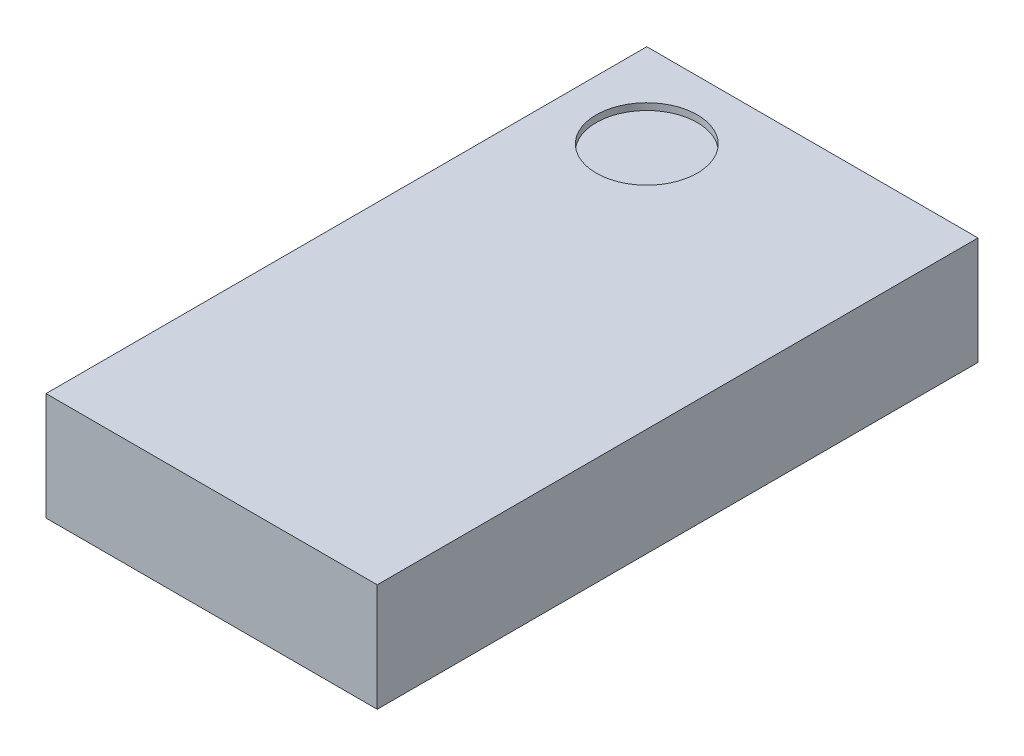
ISO-10303-21;
HEADER;
FILE_DESCRIPTION(('STEP AP214'),'2;1');
FILE_NAME('part.step','',(''),(''),'','','');
FILE_SCHEMA(('AUTOMOTIVE_DESIGN { 1 0 10303 214 1 1 1 1 }'));
ENDSEC;
DATA;
#1=APPLICATION_CONTEXT('core data for automotive mechanical design processes');
#2=APPLICATION_PROTOCOL_DEFINITION('international standard','automotive_design',2000,#1);
#3=PRODUCT_CONTEXT('',#1,'mechanical');
#4=PRODUCT('Part','Part','',(#3));
#5=PRODUCT_RELATED_PRODUCT_CATEGORY('part','',(#4));
#6=PRODUCT_DEFINITION_FORMATION('','',#4);
#7=PRODUCT_DEFINITION_CONTEXT('part definition',#1,'design');
#8=PRODUCT_DEFINITION('design','',#6,#7);
#9=PRODUCT_DEFINITION_SHAPE('','',#8);
#10=(LENGTH_UNIT() NAMED_UNIT(*) SI_UNIT(.MILLI.,.METRE.));
#11=(NAMED_UNIT(*) PLANE_ANGLE_UNIT() SI_UNIT($,.RADIAN.));
#12=(NAMED_UNIT(*) SI_UNIT($,.STERADIAN.) SOLID_ANGLE_UNIT());
#13=UNCERTAINTY_MEASURE_WITH_UNIT(LENGTH_MEASURE(1.E-05),#10,'distance_accuracy_value','');
#14=(GEOMETRIC_REPRESENTATION_CONTEXT(3) GLOBAL_UNCERTAINTY_ASSIGNED_CONTEXT((#13)) GLOBAL_UNIT_ASSIGNED_CONTEXT((#10,
#11,#12)) REPRESENTATION_CONTEXT('',''));
#15=CARTESIAN_POINT('',(0.,0.,0.));
#16=DIRECTION('',(0.,0.,1.));
#17=DIRECTION('',(1.,0.,0.));
#18=AXIS2_PLACEMENT_3D('',#15,#16,#17);
#19=CARTESIAN_POINT('',(0.4915,0.32,-0.8915));
#20=DIRECTION('',(-1.,0.,0.));
#21=DIRECTION('',(0.,0.,1.));
#22=AXIS2_PLACEMENT_3D('',#19,#20,#21);
#23=PLANE('',#22);
#24=DIRECTION('',(0.,0.,-1.));
#25=VECTOR('',#24,1.);
#26=CARTESIAN_POINT('',(0.4915,0.,-0.8915));
#27=LINE('',#26,#25);
#28=CARTESIAN_POINT('',(0.4915,0.,0.8915));
#29=VERTEX_POINT('',#28);
#30=CARTESIAN_POINT('',(0.4915,0.,-0.8915));
#31=VERTEX_POINT('',#30);
#32=EDGE_CURVE('E112',#29,#31,#27,.T.);
#33=ORIENTED_EDGE('',*,*,#32,.T.);
#34=DIRECTION('',(0.,-1.,0.));
#35=VECTOR('',#34,1.);
#36=CARTESIAN_POINT('',(0.4915,0.32,-0.8915));
#37=LINE('',#36,#35);
#38=CARTESIAN_POINT('',(0.4915,0.32,-0.8915));
#39=VERTEX_POINT('',#38);
#40=EDGE_CURVE('E101',#39,#31,#37,.T.);
#41=ORIENTED_EDGE('',*,*,#40,.F.);
#42=DIRECTION('',(0.,0.,-1.));
#43=VECTOR('',#42,1.);
#44=CARTESIAN_POINT('',(0.4915,0.32,-0.8915));
#45=LINE('',#44,#43);
#46=CARTESIAN_POINT('',(0.4915,0.32,0.8915));
#47=VERTEX_POINT('',#46);
#48=EDGE_CURVE('E93',#47,#39,#45,.T.);
#49=ORIENTED_EDGE('',*,*,#48,.F.);
#50=DIRECTION('',(0.,-1.,0.));
#51=VECTOR('',#50,1.);
#52=CARTESIAN_POINT('',(0.4915,0.32,0.8915));
#53=LINE('',#52,#51);
#54=EDGE_CURVE('E108',#47,#29,#53,.T.);
#55=ORIENTED_EDGE('',*,*,#54,.T.);
#56=EDGE_LOOP('',(#33,#41,#49,#55));
#57=FACE_BOUND('',#56,.T.);
#58=ADVANCED_FACE('F40',(#57),#23,.F.);
#59=CARTESIAN_POINT('',(-0.4915,0.32,-0.8915));
#60=DIRECTION('',(0.,0.,1.));
#61=DIRECTION('',(1.,0.,0.));
#62=AXIS2_PLACEMENT_3D('',#59,#60,#61);
#63=PLANE('',#62);
#64=DIRECTION('',(-1.,0.,0.));
#65=VECTOR('',#64,1.);
#66=CARTESIAN_POINT('',(-0.4915,0.,-0.8915));
#67=LINE('',#66,#65);
#68=CARTESIAN_POINT('',(-0.4915,0.,-0.8915));
#69=VERTEX_POINT('',#68);
#70=EDGE_CURVE('E99',#31,#69,#67,.T.);
#71=ORIENTED_EDGE('',*,*,#70,.T.);
#72=DIRECTION('',(0.,-1.,0.));
#73=VECTOR('',#72,1.);
#74=CARTESIAN_POINT('',(-0.4915,0.32,-0.8915));
#75=LINE('',#74,#73);
#76=CARTESIAN_POINT('',(-0.4915,0.32,-0.8915));
#77=VERTEX_POINT('',#76);
#78=EDGE_CURVE('E97',#77,#69,#75,.T.);
#79=ORIENTED_EDGE('',*,*,#78,.F.);
#80=DIRECTION('',(-1.,0.,0.));
#81=VECTOR('',#80,1.);
#82=CARTESIAN_POINT('',(-0.4915,0.32,-0.8915));
#83=LINE('',#82,#81);
#84=EDGE_CURVE('E88',#39,#77,#83,.T.);
#85=ORIENTED_EDGE('',*,*,#84,.F.);
#86=ORIENTED_EDGE('',*,*,#40,.T.);
#87=EDGE_LOOP('',(#71,#79,#85,#86));
#88=FACE_BOUND('',#87,.T.);
#89=ADVANCED_FACE('F98',(#88),#63,.F.);
#90=CARTESIAN_POINT('',(-0.4915,0.32,-0.8915));
#91=DIRECTION('',(1.,0.,0.));
#92=DIRECTION('',(0.,0.,-1.));
#93=AXIS2_PLACEMENT_3D('',#90,#91,#92);
#94=PLANE('',#93);
#95=DIRECTION('',(0.,0.,1.));
#96=VECTOR('',#95,1.);
#97=CARTESIAN_POINT('',(-0.4915,0.,-0.8915));
#98=LINE('',#97,#96);
#99=CARTESIAN_POINT('',(-0.4915,0.,0.8915));
#100=VERTEX_POINT('',#99);
#101=EDGE_CURVE('E74',#69,#100,#98,.T.);
#102=ORIENTED_EDGE('',*,*,#101,.T.);
#103=DIRECTION('',(0.,-1.,0.));
#104=VECTOR('',#103,1.);
#105=CARTESIAN_POINT('',(-0.4915,0.32,0.8915));
#106=LINE('',#105,#104);
#107=CARTESIAN_POINT('',(-0.4915,0.32,0.8915));
#108=VERTEX_POINT('',#107);
#109=EDGE_CURVE('E102',#108,#100,#106,.T.);
#110=ORIENTED_EDGE('',*,*,#109,.F.);
#111=DIRECTION('',(0.,0.,1.));
#112=VECTOR('',#111,1.);
#113=CARTESIAN_POINT('',(-0.4915,0.32,-0.8915));
#114=LINE('',#113,#112);
#115=EDGE_CURVE('E91',#77,#108,#114,.T.);
#116=ORIENTED_EDGE('',*,*,#115,.F.);
#117=ORIENTED_EDGE('',*,*,#78,.T.);
#118=EDGE_LOOP('',(#102,#110,#116,#117));
#119=FACE_BOUND('',#118,.T.);
#120=ADVANCED_FACE('F104',(#119),#94,.F.);
#121=CARTESIAN_POINT('',(-0.4915,0.32,0.8915));
#122=DIRECTION('',(0.,0.,-1.));
#123=DIRECTION('',(-1.,0.,0.));
#124=AXIS2_PLACEMENT_3D('',#121,#122,#123);
#125=PLANE('',#124);
#126=DIRECTION('',(1.,0.,0.));
#127=VECTOR('',#126,1.);
#128=CARTESIAN_POINT('',(-0.4915,0.,0.8915));
#129=LINE('',#128,#127);
#130=EDGE_CURVE('E80',#100,#29,#129,.T.);
#131=ORIENTED_EDGE('',*,*,#130,.T.);
#132=ORIENTED_EDGE('',*,*,#54,.F.);
#133=DIRECTION('',(1.,0.,0.));
#134=VECTOR('',#133,1.);
#135=CARTESIAN_POINT('',(-0.4915,0.32,0.8915));
#136=LINE('',#135,#134);
#137=EDGE_CURVE('E57',#108,#47,#136,.T.);
#138=ORIENTED_EDGE('',*,*,#137,.F.);
#139=ORIENTED_EDGE('',*,*,#109,.T.);
#140=EDGE_LOOP('',(#131,#132,#138,#139));
#141=FACE_BOUND('',#140,.T.);
#142=ADVANCED_FACE('F178',(#141),#125,.F.);
#143=CARTESIAN_POINT('',(0.,0.32,0.));
#144=DIRECTION('',(0.,1.,0.));
#145=DIRECTION('',(0.,0.,1.));
#146=AXIS2_PLACEMENT_3D('',#143,#144,#145);
#147=PLANE('',#146);
#148=CARTESIAN_POINT('',(-0.2415,0.32,-0.6415));
#149=DIRECTION('',(0.,1.,0.));
#150=DIRECTION('',(0.,0.,1.));
#151=AXIS2_PLACEMENT_3D('',#148,#149,#150);
#152=CIRCLE('',#151,0.15);
#153=CARTESIAN_POINT('',(-0.2415,0.32,-0.4915));
#154=VERTEX_POINT('',#153);
#155=EDGE_CURVE('E320',#154,#154,#152,.T.);
#156=ORIENTED_EDGE('',*,*,#155,.F.);
#157=EDGE_LOOP('',(#156));
#158=FACE_BOUND('',#157,.T.);
#159=ORIENTED_EDGE('',*,*,#48,.T.);
#160=ORIENTED_EDGE('',*,*,#84,.T.);
#161=ORIENTED_EDGE('',*,*,#115,.T.);
#162=ORIENTED_EDGE('',*,*,#137,.T.);
#163=EDGE_LOOP('',(#159,#160,#161,#162));
#164=FACE_BOUND('',#163,.T.);
#165=ADVANCED_FACE('F89',(#158,#164),#147,.T.);
#166=CARTESIAN_POINT('',(0.,0.,0.));
#167=DIRECTION('',(0.,1.,0.));
#168=DIRECTION('',(0.,0.,1.));
#169=AXIS2_PLACEMENT_3D('',#166,#167,#168);
#170=PLANE('',#169);
#171=CARTESIAN_POINT('',(0.2,0.,-0.6));
#172=DIRECTION('',(0.,1.,0.));
#173=DIRECTION('',(0.,0.,1.));
#174=AXIS2_PLACEMENT_3D('',#171,#172,#173);
#175=CIRCLE('',#174,0.103923048454133);
#176=CARTESIAN_POINT('',(0.2,0.,-0.496076951545868));
#177=VERTEX_POINT('',#176);
#178=EDGE_CURVE('E11',#177,#177,#175,.F.);
#179=ORIENTED_EDGE('',*,*,#178,.F.);
#180=EDGE_LOOP('',(#179));
#181=FACE_BOUND('',#180,.T.);
#182=CARTESIAN_POINT('',(-0.2,0.,-0.6));
#183=DIRECTION('',(0.,1.,0.));
#184=DIRECTION('',(0.,0.,1.));
#185=AXIS2_PLACEMENT_3D('',#182,#183,#184);
#186=CIRCLE('',#185,0.103923048454133);
#187=CARTESIAN_POINT('',(-0.2,0.,-0.496076951545868));
#188=VERTEX_POINT('',#187);
#189=EDGE_CURVE('E49',#188,#188,#186,.F.);
#190=ORIENTED_EDGE('',*,*,#189,.F.);
#191=EDGE_LOOP('',(#190));
#192=FACE_BOUND('',#191,.T.);
#193=CARTESIAN_POINT('',(0.2,0.,-0.2));
#194=DIRECTION('',(0.,1.,0.));
#195=DIRECTION('',(0.,0.,1.));
#196=AXIS2_PLACEMENT_3D('',#193,#194,#195);
#197=CIRCLE('',#196,0.103923048454133);
#198=CARTESIAN_POINT('',(0.2,0.,-0.0960769515458675));
#199=VERTEX_POINT('',#198);
#200=EDGE_CURVE('E149',#199,#199,#197,.F.);
#201=ORIENTED_EDGE('',*,*,#200,.F.);
#202=EDGE_LOOP('',(#201));
#203=FACE_BOUND('',#202,.T.);
#204=CARTESIAN_POINT('',(-0.2,0.,-0.2));
#205=DIRECTION('',(0.,1.,0.));
#206=DIRECTION('',(0.,0.,1.));
#207=AXIS2_PLACEMENT_3D('',#204,#205,#206);
#208=CIRCLE('',#207,0.103923048454133);
#209=CARTESIAN_POINT('',(-0.2,0.,-0.0960769515458675));
#210=VERTEX_POINT('',#209);
#211=EDGE_CURVE('E145',#210,#210,#208,.F.);
#212=ORIENTED_EDGE('',*,*,#211,.F.);
#213=EDGE_LOOP('',(#212));
#214=FACE_BOUND('',#213,.T.);
#215=CARTESIAN_POINT('',(0.2,0.,0.2));
#216=DIRECTION('',(0.,1.,0.));
#217=DIRECTION('',(0.,0.,1.));
#218=AXIS2_PLACEMENT_3D('',#215,#216,#217);
#219=CIRCLE('',#218,0.103923048454133);
#220=CARTESIAN_POINT('',(0.2,0.,0.303923048454133));
#221=VERTEX_POINT('',#220);
#222=EDGE_CURVE('E141',#221,#221,#219,.F.);
#223=ORIENTED_EDGE('',*,*,#222,.F.);
#224=EDGE_LOOP('',(#223));
#225=FACE_BOUND('',#224,.T.);
#226=CARTESIAN_POINT('',(-0.2,0.,0.2));
#227=DIRECTION('',(0.,1.,0.));
#228=DIRECTION('',(0.,0.,1.));
#229=AXIS2_PLACEMENT_3D('',#226,#227,#228);
#230=CIRCLE('',#229,0.103923048454133);
#231=CARTESIAN_POINT('',(-0.2,0.,0.303923048454133));
#232=VERTEX_POINT('',#231);
#233=EDGE_CURVE('E137',#232,#232,#230,.F.);
#234=ORIENTED_EDGE('',*,*,#233,.F.);
#235=EDGE_LOOP('',(#234));
#236=FACE_BOUND('',#235,.T.);
#237=CARTESIAN_POINT('',(0.2,0.,0.6));
#238=DIRECTION('',(0.,1.,0.));
#239=DIRECTION('',(0.,0.,1.));
#240=AXIS2_PLACEMENT_3D('',#237,#238,#239);
#241=CIRCLE('',#240,0.103923048454133);
#242=CARTESIAN_POINT('',(0.2,0.,0.703923048454133));
#243=VERTEX_POINT('',#242);
#244=EDGE_CURVE('E133',#243,#243,#241,.F.);
#245=ORIENTED_EDGE('',*,*,#244,.F.);
#246=EDGE_LOOP('',(#245));
#247=FACE_BOUND('',#246,.T.);
#248=CARTESIAN_POINT('',(-0.2,0.,0.6));
#249=DIRECTION('',(0.,1.,0.));
#250=DIRECTION('',(0.,0.,1.));
#251=AXIS2_PLACEMENT_3D('',#248,#249,#250);
#252=CIRCLE('',#251,0.103923048454133);
#253=CARTESIAN_POINT('',(-0.2,0.,0.703923048454133));
#254=VERTEX_POINT('',#253);
#255=EDGE_CURVE('E129',#254,#254,#252,.F.);
#256=ORIENTED_EDGE('',*,*,#255,.F.);
#257=EDGE_LOOP('',(#256));
#258=FACE_BOUND('',#257,.T.);
#259=ORIENTED_EDGE('',*,*,#32,.F.);
#260=ORIENTED_EDGE('',*,*,#130,.F.);
#261=ORIENTED_EDGE('',*,*,#101,.F.);
#262=ORIENTED_EDGE('',*,*,#70,.F.);
#263=EDGE_LOOP('',(#259,#260,#261,#262));
#264=FACE_BOUND('',#263,.T.);
#265=ADVANCED_FACE('F158',(#181,#192,#203,#214,#225,#236,#247,#258,#264),#170,.F.);
#266=CARTESIAN_POINT('',(-0.2,-0.06,0.6));
#267=DIRECTION('',(0.,-1.,0.));
#268=DIRECTION('',(-1.,0.,0.));
#269=AXIS2_PLACEMENT_3D('',#266,#267,#268);
#270=SPHERICAL_SURFACE('',#269,0.12);
#271=ORIENTED_EDGE('',*,*,#255,.T.);
#272=EDGE_LOOP('',(#271));
#273=FACE_BOUND('',#272,.T.);
#274=ADVANCED_FACE('F161',(#273),#270,.T.);
#275=CARTESIAN_POINT('',(0.2,-0.06,0.6));
#276=DIRECTION('',(0.,-1.,0.));
#277=DIRECTION('',(-1.,0.,0.));
#278=AXIS2_PLACEMENT_3D('',#275,#276,#277);
#279=SPHERICAL_SURFACE('',#278,0.12);
#280=ORIENTED_EDGE('',*,*,#244,.T.);
#281=EDGE_LOOP('',(#280));
#282=FACE_BOUND('',#281,.T.);
#283=ADVANCED_FACE('F213',(#282),#279,.T.);
#284=CARTESIAN_POINT('',(-0.2,-0.06,0.2));
#285=DIRECTION('',(0.,-1.,0.));
#286=DIRECTION('',(-1.,0.,0.));
#287=AXIS2_PLACEMENT_3D('',#284,#285,#286);
#288=SPHERICAL_SURFACE('',#287,0.12);
#289=ORIENTED_EDGE('',*,*,#233,.T.);
#290=EDGE_LOOP('',(#289));
#291=FACE_BOUND('',#290,.T.);
#292=ADVANCED_FACE('F230',(#291),#288,.T.);
#293=CARTESIAN_POINT('',(0.2,-0.06,0.2));
#294=DIRECTION('',(0.,-1.,0.));
#295=DIRECTION('',(-1.,0.,0.));
#296=AXIS2_PLACEMENT_3D('',#293,#294,#295);
#297=SPHERICAL_SURFACE('',#296,0.12);
#298=ORIENTED_EDGE('',*,*,#222,.T.);
#299=EDGE_LOOP('',(#298));
#300=FACE_BOUND('',#299,.T.);
#301=ADVANCED_FACE('F240',(#300),#297,.T.);
#302=CARTESIAN_POINT('',(-0.2,-0.06,-0.2));
#303=DIRECTION('',(0.,-1.,0.));
#304=DIRECTION('',(-1.,0.,0.));
#305=AXIS2_PLACEMENT_3D('',#302,#303,#304);
#306=SPHERICAL_SURFACE('',#305,0.12);
#307=ORIENTED_EDGE('',*,*,#211,.T.);
#308=EDGE_LOOP('',(#307));
#309=FACE_BOUND('',#308,.T.);
#310=ADVANCED_FACE('F250',(#309),#306,.T.);
#311=CARTESIAN_POINT('',(0.2,-0.06,-0.2));
#312=DIRECTION('',(0.,-1.,0.));
#313=DIRECTION('',(-1.,0.,0.));
#314=AXIS2_PLACEMENT_3D('',#311,#312,#313);
#315=SPHERICAL_SURFACE('',#314,0.12);
#316=ORIENTED_EDGE('',*,*,#200,.T.);
#317=EDGE_LOOP('',(#316));
#318=FACE_BOUND('',#317,.T.);
#319=ADVANCED_FACE('F260',(#318),#315,.T.);
#320=CARTESIAN_POINT('',(-0.2,-0.06,-0.6));
#321=DIRECTION('',(0.,-1.,0.));
#322=DIRECTION('',(-1.,0.,0.));
#323=AXIS2_PLACEMENT_3D('',#320,#321,#322);
#324=SPHERICAL_SURFACE('',#323,0.12);
#325=ORIENTED_EDGE('',*,*,#189,.T.);
#326=EDGE_LOOP('',(#325));
#327=FACE_BOUND('',#326,.T.);
#328=ADVANCED_FACE('F156',(#327),#324,.T.);
#329=CARTESIAN_POINT('',(0.2,-0.06,-0.6));
#330=DIRECTION('',(0.,-1.,0.));
#331=DIRECTION('',(-1.,0.,0.));
#332=AXIS2_PLACEMENT_3D('',#329,#330,#331);
#333=SPHERICAL_SURFACE('',#332,0.12);
#334=ORIENTED_EDGE('',*,*,#178,.T.);
#335=EDGE_LOOP('',(#334));
#336=FACE_BOUND('',#335,.T.);
#337=ADVANCED_FACE('F279',(#336),#333,.T.);
#338=CARTESIAN_POINT('',(-0.2415,0.3,-0.6415));
#339=DIRECTION('',(0.,1.,0.));
#340=DIRECTION('',(0.,0.,1.));
#341=AXIS2_PLACEMENT_3D('',#338,#339,#340);
#342=CYLINDRICAL_SURFACE('',#341,0.15);
#343=CARTESIAN_POINT('',(-0.2415,0.3,-0.6415));
#344=DIRECTION('',(0.,1.,0.));
#345=DIRECTION('',(0.,0.,1.));
#346=AXIS2_PLACEMENT_3D('',#343,#344,#345);
#347=CIRCLE('',#346,0.15);
#348=CARTESIAN_POINT('',(-0.2415,0.3,-0.4915));
#349=VERTEX_POINT('',#348);
#350=EDGE_CURVE('E116',#349,#349,#347,.T.);
#351=ORIENTED_EDGE('',*,*,#350,.F.);
#352=EDGE_LOOP('',(#351));
#353=FACE_BOUND('',#352,.T.);
#354=ORIENTED_EDGE('',*,*,#155,.T.);
#355=EDGE_LOOP('',(#354));
#356=FACE_BOUND('',#355,.T.);
#357=ADVANCED_FACE('F287',(#353,#356),#342,.F.);
#358=CARTESIAN_POINT('',(-0.2415,0.3,-0.6415));
#359=DIRECTION('',(0.,1.,0.));
#360=DIRECTION('',(0.,0.,1.));
#361=AXIS2_PLACEMENT_3D('',#358,#359,#360);
#362=PLANE('',#361);
#363=ORIENTED_EDGE('',*,*,#350,.T.);
#364=EDGE_LOOP('',(#363));
#365=FACE_BOUND('',#364,.T.);
#366=ADVANCED_FACE('F300',(#365),#362,.T.);
#367=CLOSED_SHELL('',(#58,#89,#120,#142,#165,#265,#274,#283,#292,#301,#310,#319,#328,#337,#357,#366));
#368=MANIFOLD_SOLID_BREP('B2',#367);
#369=ADVANCED_BREP_SHAPE_REPRESENTATION('',(#18,#368),#14);
#370=SHAPE_DEFINITION_REPRESENTATION(#9,#369);
ENDSEC;
END-ISO-10303-21;
